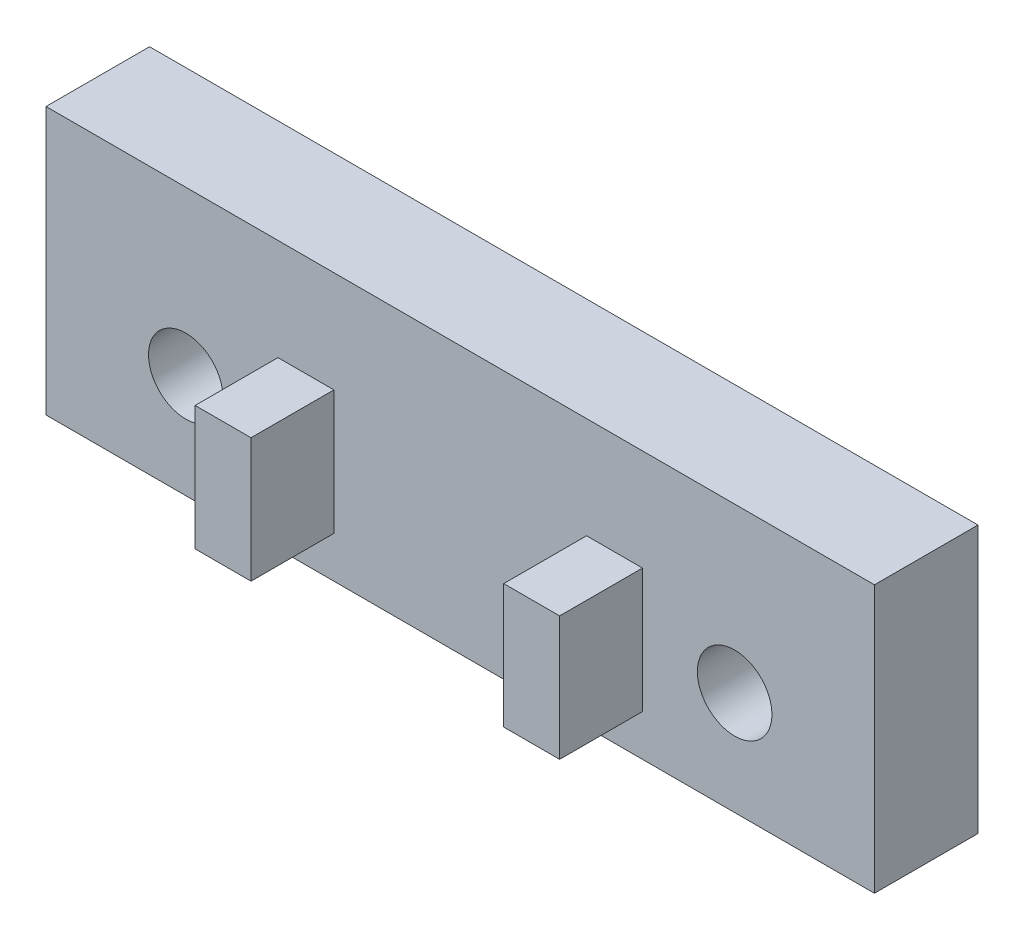
ISO-10303-21;
HEADER;
FILE_DESCRIPTION(('STEP AP214'),'2;1');
FILE_NAME('part.step','',(''),(''),'','','');
FILE_SCHEMA(('AUTOMOTIVE_DESIGN { 1 0 10303 214 1 1 1 1 }'));
ENDSEC;
DATA;
#1=APPLICATION_CONTEXT('core data for automotive mechanical design processes');
#2=APPLICATION_PROTOCOL_DEFINITION('international standard','automotive_design',2000,#1);
#3=PRODUCT_CONTEXT('',#1,'mechanical');
#4=PRODUCT('Part','Part','',(#3));
#5=PRODUCT_RELATED_PRODUCT_CATEGORY('part','',(#4));
#6=PRODUCT_DEFINITION_FORMATION('','',#4);
#7=PRODUCT_DEFINITION_CONTEXT('part definition',#1,'design');
#8=PRODUCT_DEFINITION('design','',#6,#7);
#9=PRODUCT_DEFINITION_SHAPE('','',#8);
#10=(LENGTH_UNIT() NAMED_UNIT(*) SI_UNIT(.MILLI.,.METRE.));
#11=(NAMED_UNIT(*) PLANE_ANGLE_UNIT() SI_UNIT($,.RADIAN.));
#12=(NAMED_UNIT(*) SI_UNIT($,.STERADIAN.) SOLID_ANGLE_UNIT());
#13=UNCERTAINTY_MEASURE_WITH_UNIT(LENGTH_MEASURE(1.E-05),#10,'distance_accuracy_value','');
#14=(GEOMETRIC_REPRESENTATION_CONTEXT(3) GLOBAL_UNCERTAINTY_ASSIGNED_CONTEXT((#13)) GLOBAL_UNIT_ASSIGNED_CONTEXT((#10,
#11,#12)) REPRESENTATION_CONTEXT('',''));
#15=CARTESIAN_POINT('',(0.,0.,0.));
#16=DIRECTION('',(0.,0.,1.));
#17=DIRECTION('',(1.,0.,0.));
#18=AXIS2_PLACEMENT_3D('',#15,#16,#17);
#19=CARTESIAN_POINT('',(0.,0.,5.));
#20=DIRECTION('',(0.,0.,-1.));
#21=DIRECTION('',(-1.,0.,0.));
#22=AXIS2_PLACEMENT_3D('',#19,#20,#21);
#23=PLANE('',#22);
#24=DIRECTION('',(0.,-1.,0.));
#25=VECTOR('',#24,1.);
#26=CARTESIAN_POINT('',(-8.8,3.,5.));
#27=LINE('',#26,#25);
#28=CARTESIAN_POINT('',(-8.8,3.,5.));
#29=VERTEX_POINT('',#28);
#30=CARTESIAN_POINT('',(-8.8,-3.,5.));
#31=VERTEX_POINT('',#30);
#32=EDGE_CURVE('E201',#29,#31,#27,.T.);
#33=ORIENTED_EDGE('',*,*,#32,.F.);
#34=DIRECTION('',(-1.,0.,0.));
#35=VECTOR('',#34,1.);
#36=CARTESIAN_POINT('',(-8.8,3.,5.));
#37=LINE('',#36,#35);
#38=CARTESIAN_POINT('',(-6.1,3.,5.));
#39=VERTEX_POINT('',#38);
#40=EDGE_CURVE('E206',#39,#29,#37,.T.);
#41=ORIENTED_EDGE('',*,*,#40,.F.);
#42=DIRECTION('',(0.,1.,0.));
#43=VECTOR('',#42,1.);
#44=CARTESIAN_POINT('',(-6.1,3.,5.));
#45=LINE('',#44,#43);
#46=CARTESIAN_POINT('',(-6.1,-3.,5.));
#47=VERTEX_POINT('',#46);
#48=EDGE_CURVE('E218',#47,#39,#45,.T.);
#49=ORIENTED_EDGE('',*,*,#48,.F.);
#50=DIRECTION('',(1.,0.,0.));
#51=VECTOR('',#50,1.);
#52=CARTESIAN_POINT('',(-8.8,-3.,5.));
#53=LINE('',#52,#51);
#54=EDGE_CURVE('E215',#31,#47,#53,.T.);
#55=ORIENTED_EDGE('',*,*,#54,.F.);
#56=EDGE_LOOP('',(#33,#41,#49,#55));
#57=FACE_BOUND('',#56,.T.);
#58=CARTESIAN_POINT('',(-13.25,0.,5.));
#59=DIRECTION('',(0.,0.,-1.));
#60=DIRECTION('',(-1.,0.,0.));
#61=AXIS2_PLACEMENT_3D('',#58,#59,#60);
#62=CIRCLE('',#61,1.8);
#63=CARTESIAN_POINT('',(-15.05,0.,5.));
#64=VERTEX_POINT('',#63);
#65=EDGE_CURVE('E237',#64,#64,#62,.T.);
#66=ORIENTED_EDGE('',*,*,#65,.T.);
#67=EDGE_LOOP('',(#66));
#68=FACE_BOUND('',#67,.T.);
#69=CARTESIAN_POINT('',(13.25,0.,5.));
#70=DIRECTION('',(0.,0.,-1.));
#71=DIRECTION('',(-1.,0.,0.));
#72=AXIS2_PLACEMENT_3D('',#69,#70,#71);
#73=CIRCLE('',#72,1.8);
#74=CARTESIAN_POINT('',(11.45,0.,5.));
#75=VERTEX_POINT('',#74);
#76=EDGE_CURVE('E244',#75,#75,#73,.T.);
#77=ORIENTED_EDGE('',*,*,#76,.T.);
#78=EDGE_LOOP('',(#77));
#79=FACE_BOUND('',#78,.T.);
#80=DIRECTION('',(0.,-1.,0.));
#81=VECTOR('',#80,1.);
#82=CARTESIAN_POINT('',(-20.,5.,5.));
#83=LINE('',#82,#81);
#84=CARTESIAN_POINT('',(-20.,7.9,5.));
#85=VERTEX_POINT('',#84);
#86=CARTESIAN_POINT('',(-20.,-5.,5.));
#87=VERTEX_POINT('',#86);
#88=EDGE_CURVE('E141',#85,#87,#83,.T.);
#89=ORIENTED_EDGE('',*,*,#88,.T.);
#90=DIRECTION('',(1.,0.,0.));
#91=VECTOR('',#90,1.);
#92=CARTESIAN_POINT('',(20.,-5.,5.));
#93=LINE('',#92,#91);
#94=CARTESIAN_POINT('',(20.,-5.,5.));
#95=VERTEX_POINT('',#94);
#96=EDGE_CURVE('E249',#87,#95,#93,.T.);
#97=ORIENTED_EDGE('',*,*,#96,.T.);
#98=DIRECTION('',(0.,1.,0.));
#99=VECTOR('',#98,1.);
#100=CARTESIAN_POINT('',(20.,5.,5.));
#101=LINE('',#100,#99);
#102=CARTESIAN_POINT('',(20.,7.9,5.));
#103=VERTEX_POINT('',#102);
#104=EDGE_CURVE('E252',#95,#103,#101,.T.);
#105=ORIENTED_EDGE('',*,*,#104,.T.);
#106=DIRECTION('',(1.,0.,0.));
#107=VECTOR('',#106,1.);
#108=CARTESIAN_POINT('',(-20.,7.9,5.));
#109=LINE('',#108,#107);
#110=EDGE_CURVE('E157',#85,#103,#109,.T.);
#111=ORIENTED_EDGE('',*,*,#110,.F.);
#112=EDGE_LOOP('',(#89,#97,#105,#111));
#113=FACE_BOUND('',#112,.T.);
#114=DIRECTION('',(-1.,0.,0.));
#115=VECTOR('',#114,1.);
#116=CARTESIAN_POINT('',(8.8,3.,5.));
#117=LINE('',#116,#115);
#118=CARTESIAN_POINT('',(8.8,3.,5.));
#119=VERTEX_POINT('',#118);
#120=CARTESIAN_POINT('',(6.1,3.,5.));
#121=VERTEX_POINT('',#120);
#122=EDGE_CURVE('E162',#119,#121,#117,.T.);
#123=ORIENTED_EDGE('',*,*,#122,.F.);
#124=DIRECTION('',(0.,1.,0.));
#125=VECTOR('',#124,1.);
#126=CARTESIAN_POINT('',(8.8,3.,5.));
#127=LINE('',#126,#125);
#128=CARTESIAN_POINT('',(8.8,-3.,5.));
#129=VERTEX_POINT('',#128);
#130=EDGE_CURVE('E168',#129,#119,#127,.T.);
#131=ORIENTED_EDGE('',*,*,#130,.F.);
#132=DIRECTION('',(1.,0.,0.));
#133=VECTOR('',#132,1.);
#134=CARTESIAN_POINT('',(8.8,-3.,5.));
#135=LINE('',#134,#133);
#136=CARTESIAN_POINT('',(6.1,-3.,5.));
#137=VERTEX_POINT('',#136);
#138=EDGE_CURVE('E63',#137,#129,#135,.T.);
#139=ORIENTED_EDGE('',*,*,#138,.F.);
#140=DIRECTION('',(0.,-1.,0.));
#141=VECTOR('',#140,1.);
#142=CARTESIAN_POINT('',(6.1,3.,5.));
#143=LINE('',#142,#141);
#144=EDGE_CURVE('E57',#121,#137,#143,.T.);
#145=ORIENTED_EDGE('',*,*,#144,.F.);
#146=EDGE_LOOP('',(#123,#131,#139,#145));
#147=FACE_BOUND('',#146,.T.);
#148=ADVANCED_FACE('F39',(#57,#68,#79,#113,#147),#23,.F.);
#149=CARTESIAN_POINT('',(-20.,5.,5.));
#150=DIRECTION('',(1.,0.,0.));
#151=DIRECTION('',(0.,0.,-1.));
#152=AXIS2_PLACEMENT_3D('',#149,#150,#151);
#153=PLANE('',#152);
#154=DIRECTION('',(0.,-1.,0.));
#155=VECTOR('',#154,1.);
#156=CARTESIAN_POINT('',(-20.,5.,0.));
#157=LINE('',#156,#155);
#158=CARTESIAN_POINT('',(-20.,7.9,0.));
#159=VERTEX_POINT('',#158);
#160=CARTESIAN_POINT('',(-20.,-5.,0.));
#161=VERTEX_POINT('',#160);
#162=EDGE_CURVE('E148',#159,#161,#157,.T.);
#163=ORIENTED_EDGE('',*,*,#162,.T.);
#164=DIRECTION('',(0.,0.,-1.));
#165=VECTOR('',#164,1.);
#166=CARTESIAN_POINT('',(-20.,-5.,5.));
#167=LINE('',#166,#165);
#168=EDGE_CURVE('E11',#87,#161,#167,.T.);
#169=ORIENTED_EDGE('',*,*,#168,.F.);
#170=ORIENTED_EDGE('',*,*,#88,.F.);
#171=DIRECTION('',(0.,0.,1.));
#172=VECTOR('',#171,1.);
#173=CARTESIAN_POINT('',(-20.,7.9,0.));
#174=LINE('',#173,#172);
#175=EDGE_CURVE('E152',#159,#85,#174,.T.);
#176=ORIENTED_EDGE('',*,*,#175,.F.);
#177=EDGE_LOOP('',(#163,#169,#170,#176));
#178=FACE_BOUND('',#177,.T.);
#179=ADVANCED_FACE('F41',(#178),#153,.F.);
#180=CARTESIAN_POINT('',(20.,-5.,5.));
#181=DIRECTION('',(0.,1.,0.));
#182=DIRECTION('',(0.,0.,1.));
#183=AXIS2_PLACEMENT_3D('',#180,#181,#182);
#184=PLANE('',#183);
#185=DIRECTION('',(1.,0.,0.));
#186=VECTOR('',#185,1.);
#187=CARTESIAN_POINT('',(20.,-5.,0.));
#188=LINE('',#187,#186);
#189=CARTESIAN_POINT('',(20.,-5.,0.));
#190=VERTEX_POINT('',#189);
#191=EDGE_CURVE('E142',#161,#190,#188,.T.);
#192=ORIENTED_EDGE('',*,*,#191,.T.);
#193=DIRECTION('',(0.,0.,-1.));
#194=VECTOR('',#193,1.);
#195=CARTESIAN_POINT('',(20.,-5.,5.));
#196=LINE('',#195,#194);
#197=EDGE_CURVE('E47',#95,#190,#196,.T.);
#198=ORIENTED_EDGE('',*,*,#197,.F.);
#199=ORIENTED_EDGE('',*,*,#96,.F.);
#200=ORIENTED_EDGE('',*,*,#168,.T.);
#201=EDGE_LOOP('',(#192,#198,#199,#200));
#202=FACE_BOUND('',#201,.T.);
#203=ADVANCED_FACE('F258',(#202),#184,.F.);
#204=CARTESIAN_POINT('',(20.,5.,5.));
#205=DIRECTION('',(-1.,0.,0.));
#206=DIRECTION('',(0.,0.,1.));
#207=AXIS2_PLACEMENT_3D('',#204,#205,#206);
#208=PLANE('',#207);
#209=DIRECTION('',(0.,1.,0.));
#210=VECTOR('',#209,1.);
#211=CARTESIAN_POINT('',(20.,5.,0.));
#212=LINE('',#211,#210);
#213=CARTESIAN_POINT('',(20.,7.9,0.));
#214=VERTEX_POINT('',#213);
#215=EDGE_CURVE('E133',#190,#214,#212,.T.);
#216=ORIENTED_EDGE('',*,*,#215,.T.);
#217=DIRECTION('',(0.,0.,-1.));
#218=VECTOR('',#217,1.);
#219=CARTESIAN_POINT('',(20.,7.9,5.));
#220=LINE('',#219,#218);
#221=EDGE_CURVE('E138',#103,#214,#220,.T.);
#222=ORIENTED_EDGE('',*,*,#221,.F.);
#223=ORIENTED_EDGE('',*,*,#104,.F.);
#224=ORIENTED_EDGE('',*,*,#197,.T.);
#225=EDGE_LOOP('',(#216,#222,#223,#224));
#226=FACE_BOUND('',#225,.T.);
#227=ADVANCED_FACE('F135',(#226),#208,.F.);
#228=CARTESIAN_POINT('',(0.,0.,0.));
#229=DIRECTION('',(0.,0.,-1.));
#230=DIRECTION('',(-1.,0.,0.));
#231=AXIS2_PLACEMENT_3D('',#228,#229,#230);
#232=PLANE('',#231);
#233=CARTESIAN_POINT('',(-13.25,0.,0.));
#234=DIRECTION('',(0.,0.,-1.));
#235=DIRECTION('',(-1.,0.,0.));
#236=AXIS2_PLACEMENT_3D('',#233,#234,#235);
#237=CIRCLE('',#236,1.79999999999999);
#238=CARTESIAN_POINT('',(-15.05,0.,0.));
#239=VERTEX_POINT('',#238);
#240=EDGE_CURVE('E234',#239,#239,#237,.T.);
#241=ORIENTED_EDGE('',*,*,#240,.F.);
#242=EDGE_LOOP('',(#241));
#243=FACE_BOUND('',#242,.T.);
#244=CARTESIAN_POINT('',(13.25,0.,0.));
#245=DIRECTION('',(0.,0.,-1.));
#246=DIRECTION('',(-1.,0.,0.));
#247=AXIS2_PLACEMENT_3D('',#244,#245,#246);
#248=CIRCLE('',#247,1.79999999999999);
#249=CARTESIAN_POINT('',(11.45,0.,0.));
#250=VERTEX_POINT('',#249);
#251=EDGE_CURVE('E240',#250,#250,#248,.T.);
#252=ORIENTED_EDGE('',*,*,#251,.F.);
#253=EDGE_LOOP('',(#252));
#254=FACE_BOUND('',#253,.T.);
#255=ORIENTED_EDGE('',*,*,#162,.F.);
#256=DIRECTION('',(-1.,0.,0.));
#257=VECTOR('',#256,1.);
#258=CARTESIAN_POINT('',(20.,7.9,0.));
#259=LINE('',#258,#257);
#260=EDGE_CURVE('E145',#214,#159,#259,.T.);
#261=ORIENTED_EDGE('',*,*,#260,.F.);
#262=ORIENTED_EDGE('',*,*,#215,.F.);
#263=ORIENTED_EDGE('',*,*,#191,.F.);
#264=EDGE_LOOP('',(#255,#261,#262,#263));
#265=FACE_BOUND('',#264,.T.);
#266=ADVANCED_FACE('F146',(#243,#254,#265),#232,.T.);
#267=CARTESIAN_POINT('',(13.25,0.,0.));
#268=DIRECTION('',(0.,0.,-1.));
#269=DIRECTION('',(-1.,0.,0.));
#270=AXIS2_PLACEMENT_3D('',#267,#268,#269);
#271=CYLINDRICAL_SURFACE('',#270,1.79999999999999);
#272=ORIENTED_EDGE('',*,*,#76,.F.);
#273=EDGE_LOOP('',(#272));
#274=FACE_BOUND('',#273,.T.);
#275=ORIENTED_EDGE('',*,*,#251,.T.);
#276=EDGE_LOOP('',(#275));
#277=FACE_BOUND('',#276,.T.);
#278=ADVANCED_FACE('F315',(#274,#277),#271,.F.);
#279=CARTESIAN_POINT('',(-13.25,0.,0.));
#280=DIRECTION('',(0.,0.,-1.));
#281=DIRECTION('',(-1.,0.,0.));
#282=AXIS2_PLACEMENT_3D('',#279,#280,#281);
#283=CYLINDRICAL_SURFACE('',#282,1.79999999999999);
#284=ORIENTED_EDGE('',*,*,#65,.F.);
#285=EDGE_LOOP('',(#284));
#286=FACE_BOUND('',#285,.T.);
#287=ORIENTED_EDGE('',*,*,#240,.T.);
#288=EDGE_LOOP('',(#287));
#289=FACE_BOUND('',#288,.T.);
#290=ADVANCED_FACE('F311',(#286,#289),#283,.F.);
#291=CARTESIAN_POINT('',(-8.8,3.,9.));
#292=DIRECTION('',(1.,0.,0.));
#293=DIRECTION('',(0.,0.,-1.));
#294=AXIS2_PLACEMENT_3D('',#291,#292,#293);
#295=PLANE('',#294);
#296=ORIENTED_EDGE('',*,*,#32,.T.);
#297=DIRECTION('',(0.,0.,-1.));
#298=VECTOR('',#297,1.);
#299=CARTESIAN_POINT('',(-8.8,-3.,9.));
#300=LINE('',#299,#298);
#301=CARTESIAN_POINT('',(-8.8,-3.,9.));
#302=VERTEX_POINT('',#301);
#303=EDGE_CURVE('E231',#302,#31,#300,.T.);
#304=ORIENTED_EDGE('',*,*,#303,.F.);
#305=DIRECTION('',(0.,-1.,0.));
#306=VECTOR('',#305,1.);
#307=CARTESIAN_POINT('',(-8.8,3.,9.));
#308=LINE('',#307,#306);
#309=CARTESIAN_POINT('',(-8.8,3.,9.));
#310=VERTEX_POINT('',#309);
#311=EDGE_CURVE('E202',#310,#302,#308,.T.);
#312=ORIENTED_EDGE('',*,*,#311,.F.);
#313=DIRECTION('',(0.,0.,-1.));
#314=VECTOR('',#313,1.);
#315=CARTESIAN_POINT('',(-8.8,3.,9.));
#316=LINE('',#315,#314);
#317=EDGE_CURVE('E212',#310,#29,#316,.T.);
#318=ORIENTED_EDGE('',*,*,#317,.T.);
#319=EDGE_LOOP('',(#296,#304,#312,#318));
#320=FACE_BOUND('',#319,.T.);
#321=ADVANCED_FACE('F307',(#320),#295,.F.);
#322=CARTESIAN_POINT('',(-8.8,-3.,9.));
#323=DIRECTION('',(0.,1.,0.));
#324=DIRECTION('',(0.,0.,1.));
#325=AXIS2_PLACEMENT_3D('',#322,#323,#324);
#326=PLANE('',#325);
#327=ORIENTED_EDGE('',*,*,#54,.T.);
#328=DIRECTION('',(0.,0.,-1.));
#329=VECTOR('',#328,1.);
#330=CARTESIAN_POINT('',(-6.1,-3.,9.));
#331=LINE('',#330,#329);
#332=CARTESIAN_POINT('',(-6.1,-3.,9.));
#333=VERTEX_POINT('',#332);
#334=EDGE_CURVE('E228',#333,#47,#331,.T.);
#335=ORIENTED_EDGE('',*,*,#334,.F.);
#336=DIRECTION('',(1.,0.,0.));
#337=VECTOR('',#336,1.);
#338=CARTESIAN_POINT('',(-8.8,-3.,9.));
#339=LINE('',#338,#337);
#340=EDGE_CURVE('E205',#302,#333,#339,.T.);
#341=ORIENTED_EDGE('',*,*,#340,.F.);
#342=ORIENTED_EDGE('',*,*,#303,.T.);
#343=EDGE_LOOP('',(#327,#335,#341,#342));
#344=FACE_BOUND('',#343,.T.);
#345=ADVANCED_FACE('F303',(#344),#326,.F.);
#346=CARTESIAN_POINT('',(-6.1,3.,9.));
#347=DIRECTION('',(-1.,0.,0.));
#348=DIRECTION('',(0.,0.,1.));
#349=AXIS2_PLACEMENT_3D('',#346,#347,#348);
#350=PLANE('',#349);
#351=ORIENTED_EDGE('',*,*,#48,.T.);
#352=DIRECTION('',(0.,0.,-1.));
#353=VECTOR('',#352,1.);
#354=CARTESIAN_POINT('',(-6.1,3.,9.));
#355=LINE('',#354,#353);
#356=CARTESIAN_POINT('',(-6.1,3.,9.));
#357=VERTEX_POINT('',#356);
#358=EDGE_CURVE('E225',#357,#39,#355,.T.);
#359=ORIENTED_EDGE('',*,*,#358,.F.);
#360=DIRECTION('',(0.,1.,0.));
#361=VECTOR('',#360,1.);
#362=CARTESIAN_POINT('',(-6.1,3.,9.));
#363=LINE('',#362,#361);
#364=EDGE_CURVE('E208',#333,#357,#363,.T.);
#365=ORIENTED_EDGE('',*,*,#364,.F.);
#366=ORIENTED_EDGE('',*,*,#334,.T.);
#367=EDGE_LOOP('',(#351,#359,#365,#366));
#368=FACE_BOUND('',#367,.T.);
#369=ADVANCED_FACE('F299',(#368),#350,.F.);
#370=CARTESIAN_POINT('',(-8.8,3.,9.));
#371=DIRECTION('',(0.,-1.,0.));
#372=DIRECTION('',(0.,0.,-1.));
#373=AXIS2_PLACEMENT_3D('',#370,#371,#372);
#374=PLANE('',#373);
#375=ORIENTED_EDGE('',*,*,#40,.T.);
#376=ORIENTED_EDGE('',*,*,#317,.F.);
#377=DIRECTION('',(-1.,0.,0.));
#378=VECTOR('',#377,1.);
#379=CARTESIAN_POINT('',(-8.8,3.,9.));
#380=LINE('',#379,#378);
#381=EDGE_CURVE('E210',#357,#310,#380,.T.);
#382=ORIENTED_EDGE('',*,*,#381,.F.);
#383=ORIENTED_EDGE('',*,*,#358,.T.);
#384=EDGE_LOOP('',(#375,#376,#382,#383));
#385=FACE_BOUND('',#384,.T.);
#386=ADVANCED_FACE('F295',(#385),#374,.F.);
#387=CARTESIAN_POINT('',(0.,0.,9.));
#388=DIRECTION('',(0.,0.,1.));
#389=DIRECTION('',(1.,0.,0.));
#390=AXIS2_PLACEMENT_3D('',#387,#388,#389);
#391=PLANE('',#390);
#392=ORIENTED_EDGE('',*,*,#311,.T.);
#393=ORIENTED_EDGE('',*,*,#340,.T.);
#394=ORIENTED_EDGE('',*,*,#364,.T.);
#395=ORIENTED_EDGE('',*,*,#381,.T.);
#396=EDGE_LOOP('',(#392,#393,#394,#395));
#397=FACE_BOUND('',#396,.T.);
#398=ADVANCED_FACE('F289',(#397),#391,.T.);
#399=CARTESIAN_POINT('',(8.8,3.,9.));
#400=DIRECTION('',(0.,-1.,0.));
#401=DIRECTION('',(0.,0.,-1.));
#402=AXIS2_PLACEMENT_3D('',#399,#400,#401);
#403=PLANE('',#402);
#404=ORIENTED_EDGE('',*,*,#122,.T.);
#405=DIRECTION('',(0.,0.,-1.));
#406=VECTOR('',#405,1.);
#407=CARTESIAN_POINT('',(6.1,3.,9.));
#408=LINE('',#407,#406);
#409=CARTESIAN_POINT('',(6.1,3.,9.));
#410=VERTEX_POINT('',#409);
#411=EDGE_CURVE('E198',#410,#121,#408,.T.);
#412=ORIENTED_EDGE('',*,*,#411,.F.);
#413=DIRECTION('',(-1.,0.,0.));
#414=VECTOR('',#413,1.);
#415=CARTESIAN_POINT('',(8.8,3.,9.));
#416=LINE('',#415,#414);
#417=CARTESIAN_POINT('',(8.8,3.,9.));
#418=VERTEX_POINT('',#417);
#419=EDGE_CURVE('E163',#418,#410,#416,.T.);
#420=ORIENTED_EDGE('',*,*,#419,.F.);
#421=DIRECTION('',(0.,0.,-1.));
#422=VECTOR('',#421,1.);
#423=CARTESIAN_POINT('',(8.8,3.,9.));
#424=LINE('',#423,#422);
#425=EDGE_CURVE('E177',#418,#119,#424,.T.);
#426=ORIENTED_EDGE('',*,*,#425,.T.);
#427=EDGE_LOOP('',(#404,#412,#420,#426));
#428=FACE_BOUND('',#427,.T.);
#429=ADVANCED_FACE('F273',(#428),#403,.F.);
#430=CARTESIAN_POINT('',(6.1,3.,9.));
#431=DIRECTION('',(1.,0.,0.));
#432=DIRECTION('',(0.,0.,-1.));
#433=AXIS2_PLACEMENT_3D('',#430,#431,#432);
#434=PLANE('',#433);
#435=ORIENTED_EDGE('',*,*,#144,.T.);
#436=DIRECTION('',(0.,0.,-1.));
#437=VECTOR('',#436,1.);
#438=CARTESIAN_POINT('',(6.1,-3.,9.));
#439=LINE('',#438,#437);
#440=CARTESIAN_POINT('',(6.1,-3.,9.));
#441=VERTEX_POINT('',#440);
#442=EDGE_CURVE('E194',#441,#137,#439,.T.);
#443=ORIENTED_EDGE('',*,*,#442,.F.);
#444=DIRECTION('',(0.,-1.,0.));
#445=VECTOR('',#444,1.);
#446=CARTESIAN_POINT('',(6.1,3.,9.));
#447=LINE('',#446,#445);
#448=EDGE_CURVE('E167',#410,#441,#447,.T.);
#449=ORIENTED_EDGE('',*,*,#448,.F.);
#450=ORIENTED_EDGE('',*,*,#411,.T.);
#451=EDGE_LOOP('',(#435,#443,#449,#450));
#452=FACE_BOUND('',#451,.T.);
#453=ADVANCED_FACE('F281',(#452),#434,.F.);
#454=CARTESIAN_POINT('',(8.8,-3.,9.));
#455=DIRECTION('',(0.,1.,0.));
#456=DIRECTION('',(0.,0.,1.));
#457=AXIS2_PLACEMENT_3D('',#454,#455,#456);
#458=PLANE('',#457);
#459=ORIENTED_EDGE('',*,*,#138,.T.);
#460=DIRECTION('',(0.,0.,-1.));
#461=VECTOR('',#460,1.);
#462=CARTESIAN_POINT('',(8.8,-3.,9.));
#463=LINE('',#462,#461);
#464=CARTESIAN_POINT('',(8.8,-3.,9.));
#465=VERTEX_POINT('',#464);
#466=EDGE_CURVE('E191',#465,#129,#463,.T.);
#467=ORIENTED_EDGE('',*,*,#466,.F.);
#468=DIRECTION('',(1.,0.,0.));
#469=VECTOR('',#468,1.);
#470=CARTESIAN_POINT('',(8.8,-3.,9.));
#471=LINE('',#470,#469);
#472=EDGE_CURVE('E171',#441,#465,#471,.T.);
#473=ORIENTED_EDGE('',*,*,#472,.F.);
#474=ORIENTED_EDGE('',*,*,#442,.T.);
#475=EDGE_LOOP('',(#459,#467,#473,#474));
#476=FACE_BOUND('',#475,.T.);
#477=ADVANCED_FACE('F279',(#476),#458,.F.);
#478=CARTESIAN_POINT('',(8.8,3.,9.));
#479=DIRECTION('',(-1.,0.,0.));
#480=DIRECTION('',(0.,0.,1.));
#481=AXIS2_PLACEMENT_3D('',#478,#479,#480);
#482=PLANE('',#481);
#483=ORIENTED_EDGE('',*,*,#130,.T.);
#484=ORIENTED_EDGE('',*,*,#425,.F.);
#485=DIRECTION('',(0.,1.,0.));
#486=VECTOR('',#485,1.);
#487=CARTESIAN_POINT('',(8.8,3.,9.));
#488=LINE('',#487,#486);
#489=EDGE_CURVE('E174',#465,#418,#488,.T.);
#490=ORIENTED_EDGE('',*,*,#489,.F.);
#491=ORIENTED_EDGE('',*,*,#466,.T.);
#492=EDGE_LOOP('',(#483,#484,#490,#491));
#493=FACE_BOUND('',#492,.T.);
#494=ADVANCED_FACE('F269',(#493),#482,.F.);
#495=CARTESIAN_POINT('',(0.,0.,9.));
#496=DIRECTION('',(0.,0.,1.));
#497=DIRECTION('',(1.,0.,0.));
#498=AXIS2_PLACEMENT_3D('',#495,#496,#497);
#499=PLANE('',#498);
#500=ORIENTED_EDGE('',*,*,#419,.T.);
#501=ORIENTED_EDGE('',*,*,#448,.T.);
#502=ORIENTED_EDGE('',*,*,#472,.T.);
#503=ORIENTED_EDGE('',*,*,#489,.T.);
#504=EDGE_LOOP('',(#500,#501,#502,#503));
#505=FACE_BOUND('',#504,.T.);
#506=ADVANCED_FACE('F275',(#505),#499,.T.);
#507=CARTESIAN_POINT('',(0.,7.9,0.));
#508=DIRECTION('',(0.,1.,0.));
#509=DIRECTION('',(0.,0.,1.));
#510=AXIS2_PLACEMENT_3D('',#507,#508,#509);
#511=PLANE('',#510);
#512=ORIENTED_EDGE('',*,*,#221,.T.);
#513=ORIENTED_EDGE('',*,*,#260,.T.);
#514=ORIENTED_EDGE('',*,*,#175,.T.);
#515=ORIENTED_EDGE('',*,*,#110,.T.);
#516=EDGE_LOOP('',(#512,#513,#514,#515));
#517=FACE_BOUND('',#516,.T.);
#518=ADVANCED_FACE('F155',(#517),#511,.T.);
#519=CLOSED_SHELL('',(#148,#179,#203,#227,#266,#278,#290,#321,#345,#369,#386,#398,#429,#453,
#477,#494,#506,#518));
#520=MANIFOLD_SOLID_BREP('B2',#519);
#521=ADVANCED_BREP_SHAPE_REPRESENTATION('',(#18,#520),#14);
#522=SHAPE_DEFINITION_REPRESENTATION(#9,#521);
ENDSEC;
END-ISO-10303-21;
